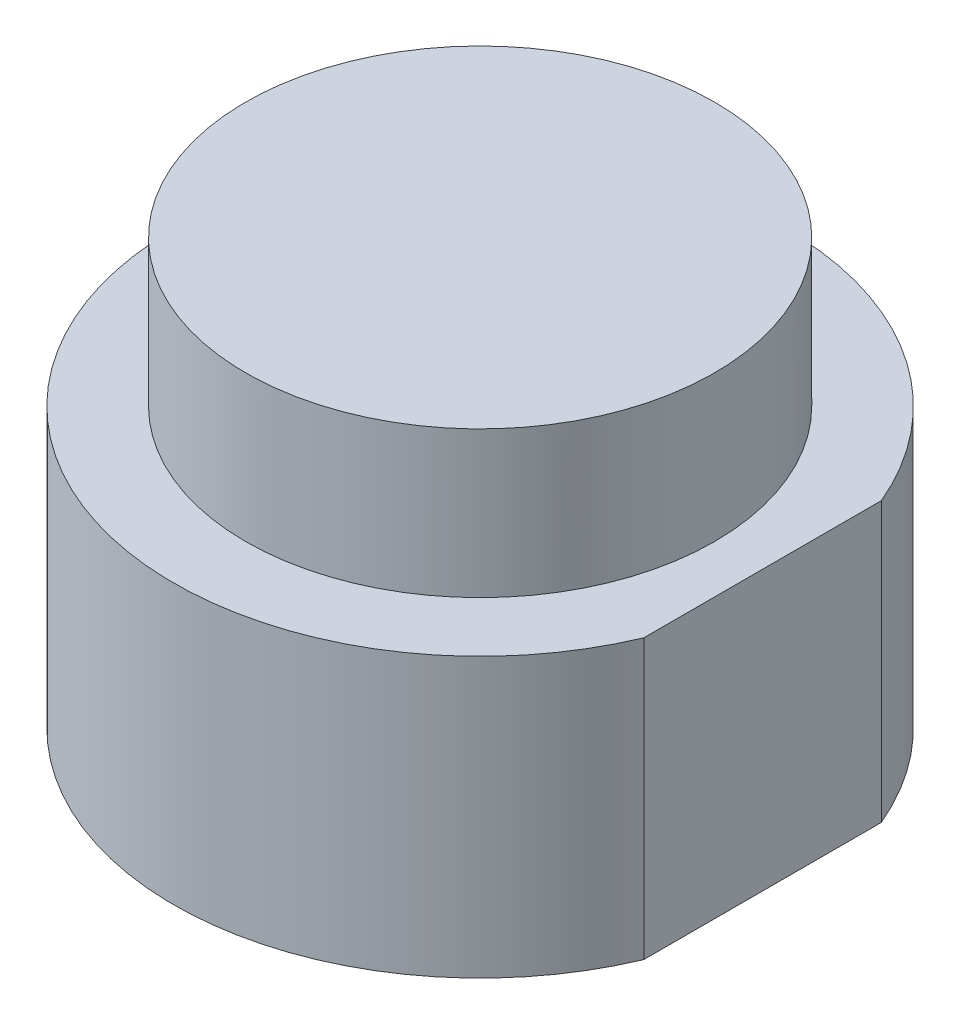
ISO-10303-21;
HEADER;
FILE_DESCRIPTION(('STEP AP214'),'2;1');
FILE_NAME('part.step','',(''),(''),'','','');
FILE_SCHEMA(('AUTOMOTIVE_DESIGN { 1 0 10303 214 1 1 1 1 }'));
ENDSEC;
DATA;
#1=APPLICATION_CONTEXT('core data for automotive mechanical design processes');
#2=APPLICATION_PROTOCOL_DEFINITION('international standard','automotive_design',2000,#1);
#3=PRODUCT_CONTEXT('',#1,'mechanical');
#4=PRODUCT('Part','Part','',(#3));
#5=PRODUCT_RELATED_PRODUCT_CATEGORY('part','',(#4));
#6=PRODUCT_DEFINITION_FORMATION('','',#4);
#7=PRODUCT_DEFINITION_CONTEXT('part definition',#1,'design');
#8=PRODUCT_DEFINITION('design','',#6,#7);
#9=PRODUCT_DEFINITION_SHAPE('','',#8);
#10=(LENGTH_UNIT() NAMED_UNIT(*) SI_UNIT(.MILLI.,.METRE.));
#11=(NAMED_UNIT(*) PLANE_ANGLE_UNIT() SI_UNIT($,.RADIAN.));
#12=(NAMED_UNIT(*) SI_UNIT($,.STERADIAN.) SOLID_ANGLE_UNIT());
#13=UNCERTAINTY_MEASURE_WITH_UNIT(LENGTH_MEASURE(1.E-05),#10,'distance_accuracy_value','');
#14=(GEOMETRIC_REPRESENTATION_CONTEXT(3) GLOBAL_UNCERTAINTY_ASSIGNED_CONTEXT((#13)) GLOBAL_UNIT_ASSIGNED_CONTEXT((#10,
#11,#12)) REPRESENTATION_CONTEXT('',''));
#15=CARTESIAN_POINT('',(0.,0.,0.));
#16=DIRECTION('',(0.,0.,1.));
#17=DIRECTION('',(1.,0.,0.));
#18=AXIS2_PLACEMENT_3D('',#15,#16,#17);
#19=CARTESIAN_POINT('',(0.,23.65,0.));
#20=DIRECTION('',(0.,-1.,0.));
#21=DIRECTION('',(0.,0.,-1.));
#22=AXIS2_PLACEMENT_3D('',#19,#20,#21);
#23=CYLINDRICAL_SURFACE('',#22,26.);
#24=CARTESIAN_POINT('',(0.,23.65,0.));
#25=DIRECTION('',(0.,1.,0.));
#26=DIRECTION('',(0.,0.,1.));
#27=AXIS2_PLACEMENT_3D('',#24,#25,#26);
#28=CIRCLE('',#27,26.);
#29=CARTESIAN_POINT('',(23.9669389114127,23.65,-10.0789800682714));
#30=VERTEX_POINT('',#29);
#31=CARTESIAN_POINT('',(23.9669389114127,23.65,10.0789800682714));
#32=VERTEX_POINT('',#31);
#33=EDGE_CURVE('E47',#30,#32,#28,.T.);
#34=ORIENTED_EDGE('',*,*,#33,.F.);
#35=DIRECTION('',(0.,-1.,0.));
#36=VECTOR('',#35,1.);
#37=CARTESIAN_POINT('',(23.9669389114127,36.05,-10.0789800682714));
#38=LINE('',#37,#36);
#39=CARTESIAN_POINT('',(23.9669389114127,0.,-10.0789800682714));
#40=VERTEX_POINT('',#39);
#41=EDGE_CURVE('E60',#30,#40,#38,.T.);
#42=ORIENTED_EDGE('',*,*,#41,.T.);
#43=CARTESIAN_POINT('',(0.,0.,0.));
#44=DIRECTION('',(0.,1.,0.));
#45=DIRECTION('',(0.,0.,1.));
#46=AXIS2_PLACEMENT_3D('',#43,#44,#45);
#47=CIRCLE('',#46,26.);
#48=CARTESIAN_POINT('',(23.9669389114127,0.,10.0789800682713));
#49=VERTEX_POINT('',#48);
#50=EDGE_CURVE('E42',#40,#49,#47,.T.);
#51=ORIENTED_EDGE('',*,*,#50,.T.);
#52=DIRECTION('',(0.,-1.,0.));
#53=VECTOR('',#52,1.);
#54=CARTESIAN_POINT('',(23.9669389114127,36.05,10.0789800682714));
#55=LINE('',#54,#53);
#56=EDGE_CURVE('E55',#32,#49,#55,.T.);
#57=ORIENTED_EDGE('',*,*,#56,.F.);
#58=EDGE_LOOP('',(#34,#42,#51,#57));
#59=FACE_BOUND('',#58,.T.);
#60=ADVANCED_FACE('F39',(#59),#23,.T.);
#61=CARTESIAN_POINT('',(0.,23.65,0.));
#62=DIRECTION('',(0.,1.,0.));
#63=DIRECTION('',(0.,0.,1.));
#64=AXIS2_PLACEMENT_3D('',#61,#62,#63);
#65=PLANE('',#64);
#66=DIRECTION('',(0.,0.,1.));
#67=VECTOR('',#66,1.);
#68=CARTESIAN_POINT('',(23.9669389114127,23.65,0.));
#69=LINE('',#68,#67);
#70=EDGE_CURVE('E75',#30,#32,#69,.T.);
#71=ORIENTED_EDGE('',*,*,#70,.F.);
#72=ORIENTED_EDGE('',*,*,#33,.T.);
#73=EDGE_LOOP('',(#71,#72));
#74=FACE_BOUND('',#73,.T.);
#75=CARTESIAN_POINT('',(0.,23.65,0.));
#76=DIRECTION('',(0.,1.,0.));
#77=DIRECTION('',(0.,0.,1.));
#78=AXIS2_PLACEMENT_3D('',#75,#76,#77);
#79=CIRCLE('',#78,19.9);
#80=CARTESIAN_POINT('',(0.,23.65,19.9));
#81=VERTEX_POINT('',#80);
#82=EDGE_CURVE('E11',#81,#81,#79,.T.);
#83=ORIENTED_EDGE('',*,*,#82,.F.);
#84=EDGE_LOOP('',(#83));
#85=FACE_BOUND('',#84,.T.);
#86=ADVANCED_FACE('F110',(#74,#85),#65,.T.);
#87=CARTESIAN_POINT('',(0.,0.,0.));
#88=DIRECTION('',(0.,1.,0.));
#89=DIRECTION('',(0.,0.,1.));
#90=AXIS2_PLACEMENT_3D('',#87,#88,#89);
#91=PLANE('',#90);
#92=CARTESIAN_POINT('',(14.0007142674936,0.,14.0007142674937));
#93=DIRECTION('',(0.,-1.,0.));
#94=DIRECTION('',(0.,0.,-1.));
#95=AXIS2_PLACEMENT_3D('',#92,#93,#94);
#96=CIRCLE('',#95,1.25);
#97=CARTESIAN_POINT('',(14.0007142674936,0.,12.7507142674937));
#98=VERTEX_POINT('',#97);
#99=EDGE_CURVE('E92',#98,#98,#96,.T.);
#100=ORIENTED_EDGE('',*,*,#99,.F.);
#101=EDGE_LOOP('',(#100));
#102=FACE_BOUND('',#101,.T.);
#103=CARTESIAN_POINT('',(-14.0007142674936,0.,-14.0007142674937));
#104=DIRECTION('',(0.,-1.,0.));
#105=DIRECTION('',(0.,0.,-1.));
#106=AXIS2_PLACEMENT_3D('',#103,#104,#105);
#107=CIRCLE('',#106,1.25);
#108=CARTESIAN_POINT('',(-14.0007142674936,0.,-15.2507142674937));
#109=VERTEX_POINT('',#108);
#110=EDGE_CURVE('E89',#109,#109,#107,.T.);
#111=ORIENTED_EDGE('',*,*,#110,.F.);
#112=EDGE_LOOP('',(#111));
#113=FACE_BOUND('',#112,.T.);
#114=ORIENTED_EDGE('',*,*,#50,.F.);
#115=DIRECTION('',(0.,0.,-1.));
#116=VECTOR('',#115,1.);
#117=CARTESIAN_POINT('',(23.9669389114127,0.,10.0789800682714));
#118=LINE('',#117,#116);
#119=EDGE_CURVE('E65',#49,#40,#118,.T.);
#120=ORIENTED_EDGE('',*,*,#119,.F.);
#121=EDGE_LOOP('',(#114,#120));
#122=FACE_BOUND('',#121,.T.);
#123=ADVANCED_FACE('F77',(#102,#113,#122),#91,.F.);
#124=CARTESIAN_POINT('',(0.,36.05,0.));
#125=DIRECTION('',(0.,-1.,0.));
#126=DIRECTION('',(0.,0.,-1.));
#127=AXIS2_PLACEMENT_3D('',#124,#125,#126);
#128=CYLINDRICAL_SURFACE('',#127,19.9);
#129=ORIENTED_EDGE('',*,*,#82,.T.);
#130=EDGE_LOOP('',(#129));
#131=FACE_BOUND('',#130,.T.);
#132=CARTESIAN_POINT('',(0.,36.05,0.));
#133=DIRECTION('',(0.,-1.,0.));
#134=DIRECTION('',(0.,0.,-1.));
#135=AXIS2_PLACEMENT_3D('',#132,#133,#134);
#136=CIRCLE('',#135,19.9);
#137=CARTESIAN_POINT('',(0.,36.05,-19.9));
#138=VERTEX_POINT('',#137);
#139=EDGE_CURVE('E78',#138,#138,#136,.T.);
#140=ORIENTED_EDGE('',*,*,#139,.T.);
#141=EDGE_LOOP('',(#140));
#142=FACE_BOUND('',#141,.T.);
#143=ADVANCED_FACE('F109',(#131,#142),#128,.T.);
#144=CARTESIAN_POINT('',(0.,36.05,0.));
#145=DIRECTION('',(0.,-1.,0.));
#146=DIRECTION('',(0.,0.,-1.));
#147=AXIS2_PLACEMENT_3D('',#144,#145,#146);
#148=PLANE('',#147);
#149=ORIENTED_EDGE('',*,*,#139,.F.);
#150=EDGE_LOOP('',(#149));
#151=FACE_BOUND('',#150,.T.);
#152=ADVANCED_FACE('F123',(#151),#148,.F.);
#153=CARTESIAN_POINT('',(23.9669389114127,36.05,10.0789800682714));
#154=DIRECTION('',(-1.,0.,0.));
#155=DIRECTION('',(0.,0.,1.));
#156=AXIS2_PLACEMENT_3D('',#153,#154,#155);
#157=PLANE('',#156);
#158=ORIENTED_EDGE('',*,*,#70,.T.);
#159=ORIENTED_EDGE('',*,*,#56,.T.);
#160=ORIENTED_EDGE('',*,*,#119,.T.);
#161=ORIENTED_EDGE('',*,*,#41,.F.);
#162=EDGE_LOOP('',(#158,#159,#160,#161));
#163=FACE_BOUND('',#162,.T.);
#164=ADVANCED_FACE('F66',(#163),#157,.F.);
#165=CARTESIAN_POINT('',(-14.0007142674936,2.,-14.0007142674937));
#166=DIRECTION('',(0.,-1.,0.));
#167=DIRECTION('',(0.,0.,-1.));
#168=AXIS2_PLACEMENT_3D('',#165,#166,#167);
#169=CYLINDRICAL_SURFACE('',#168,1.25);
#170=CARTESIAN_POINT('',(-14.0007142674936,2.,-14.0007142674937));
#171=DIRECTION('',(0.,-1.,0.));
#172=DIRECTION('',(0.,0.,-1.));
#173=AXIS2_PLACEMENT_3D('',#170,#171,#172);
#174=CIRCLE('',#173,1.25);
#175=CARTESIAN_POINT('',(-14.0007142674936,2.,-15.2507142674937));
#176=VERTEX_POINT('',#175);
#177=EDGE_CURVE('E86',#176,#176,#174,.T.);
#178=ORIENTED_EDGE('',*,*,#177,.F.);
#179=EDGE_LOOP('',(#178));
#180=FACE_BOUND('',#179,.T.);
#181=ORIENTED_EDGE('',*,*,#110,.T.);
#182=EDGE_LOOP('',(#181));
#183=FACE_BOUND('',#182,.T.);
#184=ADVANCED_FACE('F113',(#180,#183),#169,.F.);
#185=CARTESIAN_POINT('',(-14.0007142674936,2.,-14.0007142674937));
#186=DIRECTION('',(0.,-1.,0.));
#187=DIRECTION('',(0.,0.,-1.));
#188=AXIS2_PLACEMENT_3D('',#185,#186,#187);
#189=PLANE('',#188);
#190=ORIENTED_EDGE('',*,*,#177,.T.);
#191=EDGE_LOOP('',(#190));
#192=FACE_BOUND('',#191,.T.);
#193=ADVANCED_FACE('F103',(#192),#189,.T.);
#194=CARTESIAN_POINT('',(14.0007142674936,2.,14.0007142674937));
#195=DIRECTION('',(0.,-1.,0.));
#196=DIRECTION('',(0.,0.,-1.));
#197=AXIS2_PLACEMENT_3D('',#194,#195,#196);
#198=CYLINDRICAL_SURFACE('',#197,1.25);
#199=CARTESIAN_POINT('',(14.0007142674936,2.,14.0007142674937));
#200=DIRECTION('',(0.,-1.,0.));
#201=DIRECTION('',(0.,0.,-1.));
#202=AXIS2_PLACEMENT_3D('',#199,#200,#201);
#203=CIRCLE('',#202,1.25);
#204=CARTESIAN_POINT('',(14.0007142674936,2.,12.7507142674937));
#205=VERTEX_POINT('',#204);
#206=EDGE_CURVE('E70',#205,#205,#203,.T.);
#207=ORIENTED_EDGE('',*,*,#206,.F.);
#208=EDGE_LOOP('',(#207));
#209=FACE_BOUND('',#208,.T.);
#210=ORIENTED_EDGE('',*,*,#99,.T.);
#211=EDGE_LOOP('',(#210));
#212=FACE_BOUND('',#211,.T.);
#213=ADVANCED_FACE('F100',(#209,#212),#198,.F.);
#214=CARTESIAN_POINT('',(14.0007142674936,2.,14.0007142674937));
#215=DIRECTION('',(0.,-1.,0.));
#216=DIRECTION('',(0.,0.,-1.));
#217=AXIS2_PLACEMENT_3D('',#214,#215,#216);
#218=PLANE('',#217);
#219=ORIENTED_EDGE('',*,*,#206,.T.);
#220=EDGE_LOOP('',(#219));
#221=FACE_BOUND('',#220,.T.);
#222=ADVANCED_FACE('F98',(#221),#218,.T.);
#223=CLOSED_SHELL('',(#60,#86,#123,#143,#152,#164,#184,#193,#213,#222));
#224=MANIFOLD_SOLID_BREP('B2',#223);
#225=ADVANCED_BREP_SHAPE_REPRESENTATION('',(#18,#224),#14);
#226=SHAPE_DEFINITION_REPRESENTATION(#9,#225);
ENDSEC;
END-ISO-10303-21;
